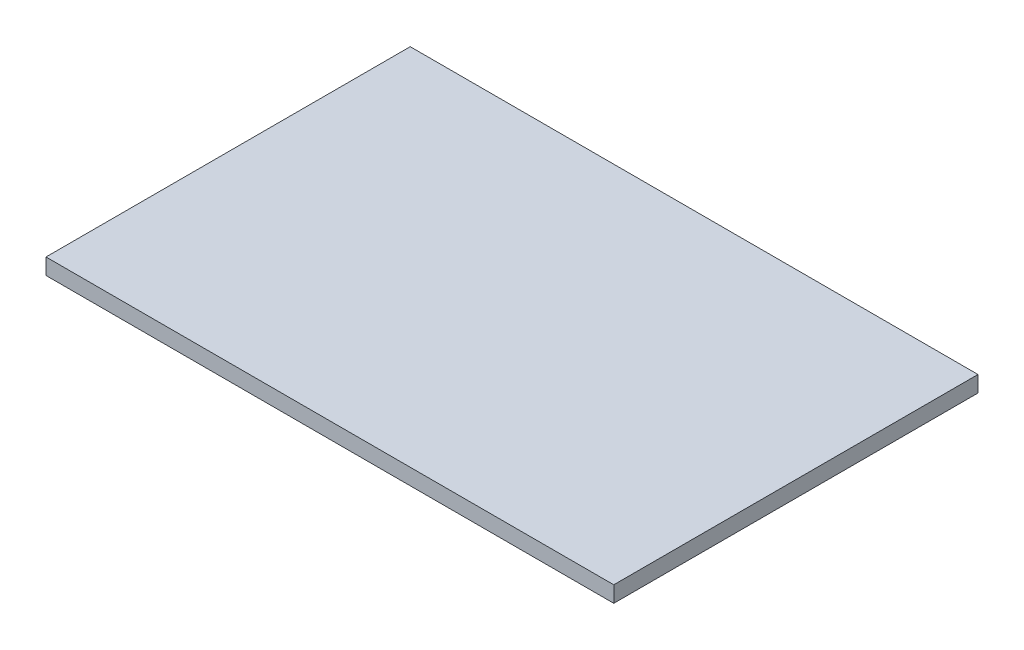
ISO-10303-21;
HEADER;
FILE_DESCRIPTION(('STEP AP214'),'2;1');
FILE_NAME('part.step','',(''),(''),'','','');
FILE_SCHEMA(('AUTOMOTIVE_DESIGN { 1 0 10303 214 1 1 1 1 }'));
ENDSEC;
DATA;
#1=APPLICATION_CONTEXT('core data for automotive mechanical design processes');
#2=APPLICATION_PROTOCOL_DEFINITION('international standard','automotive_design',2000,#1);
#3=PRODUCT_CONTEXT('',#1,'mechanical');
#4=PRODUCT('Part','Part','',(#3));
#5=PRODUCT_RELATED_PRODUCT_CATEGORY('part','',(#4));
#6=PRODUCT_DEFINITION_FORMATION('','',#4);
#7=PRODUCT_DEFINITION_CONTEXT('part definition',#1,'design');
#8=PRODUCT_DEFINITION('design','',#6,#7);
#9=PRODUCT_DEFINITION_SHAPE('','',#8);
#10=(LENGTH_UNIT() NAMED_UNIT(*) SI_UNIT(.MILLI.,.METRE.));
#11=(NAMED_UNIT(*) PLANE_ANGLE_UNIT() SI_UNIT($,.RADIAN.));
#12=(NAMED_UNIT(*) SI_UNIT($,.STERADIAN.) SOLID_ANGLE_UNIT());
#13=UNCERTAINTY_MEASURE_WITH_UNIT(LENGTH_MEASURE(1.E-05),#10,'distance_accuracy_value','');
#14=(GEOMETRIC_REPRESENTATION_CONTEXT(3) GLOBAL_UNCERTAINTY_ASSIGNED_CONTEXT((#13)) GLOBAL_UNIT_ASSIGNED_CONTEXT((#10,
#11,#12)) REPRESENTATION_CONTEXT('',''));
#15=CARTESIAN_POINT('',(0.,0.,0.));
#16=DIRECTION('',(0.,0.,1.));
#17=DIRECTION('',(1.,0.,0.));
#18=AXIS2_PLACEMENT_3D('',#15,#16,#17);
#19=CARTESIAN_POINT('',(2778.42347826087,3.81,-891.304347826087));
#20=DIRECTION('',(1.,0.,0.));
#21=DIRECTION('',(0.,0.,-1.));
#22=AXIS2_PLACEMENT_3D('',#19,#20,#21);
#23=PLANE('',#22);
#24=DIRECTION('',(0.,0.,1.));
#25=VECTOR('',#24,1.);
#26=CARTESIAN_POINT('',(2778.42347826087,0.,-891.304347826087));
#27=LINE('',#26,#25);
#28=CARTESIAN_POINT('',(2778.42347826087,0.,-891.304347826087));
#29=VERTEX_POINT('',#28);
#30=CARTESIAN_POINT('',(2778.42347826087,0.,-804.944347826087));
#31=VERTEX_POINT('',#30);
#32=EDGE_CURVE('E96',#29,#31,#27,.T.);
#33=ORIENTED_EDGE('',*,*,#32,.T.);
#34=DIRECTION('',(0.,-1.,0.));
#35=VECTOR('',#34,1.);
#36=CARTESIAN_POINT('',(2778.42347826087,3.81,-804.944347826087));
#37=LINE('',#36,#35);
#38=CARTESIAN_POINT('',(2778.42347826087,3.81,-804.944347826087));
#39=VERTEX_POINT('',#38);
#40=EDGE_CURVE('E11',#39,#31,#37,.T.);
#41=ORIENTED_EDGE('',*,*,#40,.F.);
#42=DIRECTION('',(0.,0.,1.));
#43=VECTOR('',#42,1.);
#44=CARTESIAN_POINT('',(2778.42347826087,3.81,-891.304347826087));
#45=LINE('',#44,#43);
#46=CARTESIAN_POINT('',(2778.42347826087,3.81,-891.304347826087));
#47=VERTEX_POINT('',#46);
#48=EDGE_CURVE('E84',#47,#39,#45,.T.);
#49=ORIENTED_EDGE('',*,*,#48,.F.);
#50=DIRECTION('',(0.,-1.,0.));
#51=VECTOR('',#50,1.);
#52=CARTESIAN_POINT('',(2778.42347826087,3.81,-891.304347826087));
#53=LINE('',#52,#51);
#54=EDGE_CURVE('E92',#47,#29,#53,.T.);
#55=ORIENTED_EDGE('',*,*,#54,.T.);
#56=EDGE_LOOP('',(#33,#41,#49,#55));
#57=FACE_BOUND('',#56,.T.);
#58=ADVANCED_FACE('F33',(#57),#23,.F.);
#59=CARTESIAN_POINT('',(2778.42347826087,3.81,-804.944347826087));
#60=DIRECTION('',(0.,0.,-1.));
#61=DIRECTION('',(-1.,0.,0.));
#62=AXIS2_PLACEMENT_3D('',#59,#60,#61);
#63=PLANE('',#62);
#64=DIRECTION('',(1.,0.,0.));
#65=VECTOR('',#64,1.);
#66=CARTESIAN_POINT('',(2778.42347826087,0.,-804.944347826087));
#67=LINE('',#66,#65);
#68=CARTESIAN_POINT('',(2913.04347826087,0.,-804.944347826087));
#69=VERTEX_POINT('',#68);
#70=EDGE_CURVE('E88',#31,#69,#67,.T.);
#71=ORIENTED_EDGE('',*,*,#70,.T.);
#72=DIRECTION('',(0.,-1.,0.));
#73=VECTOR('',#72,1.);
#74=CARTESIAN_POINT('',(2913.04347826087,3.81,-804.944347826087));
#75=LINE('',#74,#73);
#76=CARTESIAN_POINT('',(2913.04347826087,3.81,-804.944347826087));
#77=VERTEX_POINT('',#76);
#78=EDGE_CURVE('E41',#77,#69,#75,.T.);
#79=ORIENTED_EDGE('',*,*,#78,.F.);
#80=DIRECTION('',(1.,0.,0.));
#81=VECTOR('',#80,1.);
#82=CARTESIAN_POINT('',(2778.42347826087,3.81,-804.944347826087));
#83=LINE('',#82,#81);
#84=EDGE_CURVE('E79',#39,#77,#83,.T.);
#85=ORIENTED_EDGE('',*,*,#84,.F.);
#86=ORIENTED_EDGE('',*,*,#40,.T.);
#87=EDGE_LOOP('',(#71,#79,#85,#86));
#88=FACE_BOUND('',#87,.T.);
#89=ADVANCED_FACE('F87',(#88),#63,.F.);
#90=CARTESIAN_POINT('',(2913.04347826087,3.81,-891.304347826087));
#91=DIRECTION('',(-1.,0.,0.));
#92=DIRECTION('',(0.,0.,1.));
#93=AXIS2_PLACEMENT_3D('',#90,#91,#92);
#94=PLANE('',#93);
#95=DIRECTION('',(0.,0.,-1.));
#96=VECTOR('',#95,1.);
#97=CARTESIAN_POINT('',(2913.04347826087,0.,-891.304347826087));
#98=LINE('',#97,#96);
#99=CARTESIAN_POINT('',(2913.04347826087,0.,-891.304347826087));
#100=VERTEX_POINT('',#99);
#101=EDGE_CURVE('E66',#69,#100,#98,.T.);
#102=ORIENTED_EDGE('',*,*,#101,.T.);
#103=DIRECTION('',(0.,-1.,0.));
#104=VECTOR('',#103,1.);
#105=CARTESIAN_POINT('',(2913.04347826087,3.81,-891.304347826087));
#106=LINE('',#105,#104);
#107=CARTESIAN_POINT('',(2913.04347826087,3.81,-891.304347826087));
#108=VERTEX_POINT('',#107);
#109=EDGE_CURVE('E89',#108,#100,#106,.T.);
#110=ORIENTED_EDGE('',*,*,#109,.F.);
#111=DIRECTION('',(0.,0.,-1.));
#112=VECTOR('',#111,1.);
#113=CARTESIAN_POINT('',(2913.04347826087,3.81,-891.304347826087));
#114=LINE('',#113,#112);
#115=EDGE_CURVE('E82',#77,#108,#114,.T.);
#116=ORIENTED_EDGE('',*,*,#115,.F.);
#117=ORIENTED_EDGE('',*,*,#78,.T.);
#118=EDGE_LOOP('',(#102,#110,#116,#117));
#119=FACE_BOUND('',#118,.T.);
#120=ADVANCED_FACE('F90',(#119),#94,.F.);
#121=CARTESIAN_POINT('',(2778.42347826087,3.81,-891.304347826087));
#122=DIRECTION('',(0.,0.,1.));
#123=DIRECTION('',(1.,0.,0.));
#124=AXIS2_PLACEMENT_3D('',#121,#122,#123);
#125=PLANE('',#124);
#126=DIRECTION('',(-1.,0.,0.));
#127=VECTOR('',#126,1.);
#128=CARTESIAN_POINT('',(2778.42347826087,0.,-891.304347826087));
#129=LINE('',#128,#127);
#130=EDGE_CURVE('E72',#100,#29,#129,.T.);
#131=ORIENTED_EDGE('',*,*,#130,.T.);
#132=ORIENTED_EDGE('',*,*,#54,.F.);
#133=DIRECTION('',(-1.,0.,0.));
#134=VECTOR('',#133,1.);
#135=CARTESIAN_POINT('',(2778.42347826087,3.81,-891.304347826087));
#136=LINE('',#135,#134);
#137=EDGE_CURVE('E49',#108,#47,#136,.T.);
#138=ORIENTED_EDGE('',*,*,#137,.F.);
#139=ORIENTED_EDGE('',*,*,#109,.T.);
#140=EDGE_LOOP('',(#131,#132,#138,#139));
#141=FACE_BOUND('',#140,.T.);
#142=ADVANCED_FACE('F103',(#141),#125,.F.);
#143=CARTESIAN_POINT('',(0.,3.81,0.));
#144=DIRECTION('',(0.,1.,0.));
#145=DIRECTION('',(0.,0.,1.));
#146=AXIS2_PLACEMENT_3D('',#143,#144,#145);
#147=PLANE('',#146);
#148=ORIENTED_EDGE('',*,*,#48,.T.);
#149=ORIENTED_EDGE('',*,*,#84,.T.);
#150=ORIENTED_EDGE('',*,*,#115,.T.);
#151=ORIENTED_EDGE('',*,*,#137,.T.);
#152=EDGE_LOOP('',(#148,#149,#150,#151));
#153=FACE_BOUND('',#152,.T.);
#154=ADVANCED_FACE('F80',(#153),#147,.T.);
#155=CARTESIAN_POINT('',(0.,0.,0.));
#156=DIRECTION('',(0.,1.,0.));
#157=DIRECTION('',(0.,0.,1.));
#158=AXIS2_PLACEMENT_3D('',#155,#156,#157);
#159=PLANE('',#158);
#160=ORIENTED_EDGE('',*,*,#32,.F.);
#161=ORIENTED_EDGE('',*,*,#130,.F.);
#162=ORIENTED_EDGE('',*,*,#101,.F.);
#163=ORIENTED_EDGE('',*,*,#70,.F.);
#164=EDGE_LOOP('',(#160,#161,#162,#163));
#165=FACE_BOUND('',#164,.T.);
#166=ADVANCED_FACE('F106',(#165),#159,.F.);
#167=CLOSED_SHELL('',(#58,#89,#120,#142,#154,#166));
#168=MANIFOLD_SOLID_BREP('B2',#167);
#169=ADVANCED_BREP_SHAPE_REPRESENTATION('',(#18,#168),#14);
#170=SHAPE_DEFINITION_REPRESENTATION(#9,#169);
ENDSEC;
END-ISO-10303-21;
